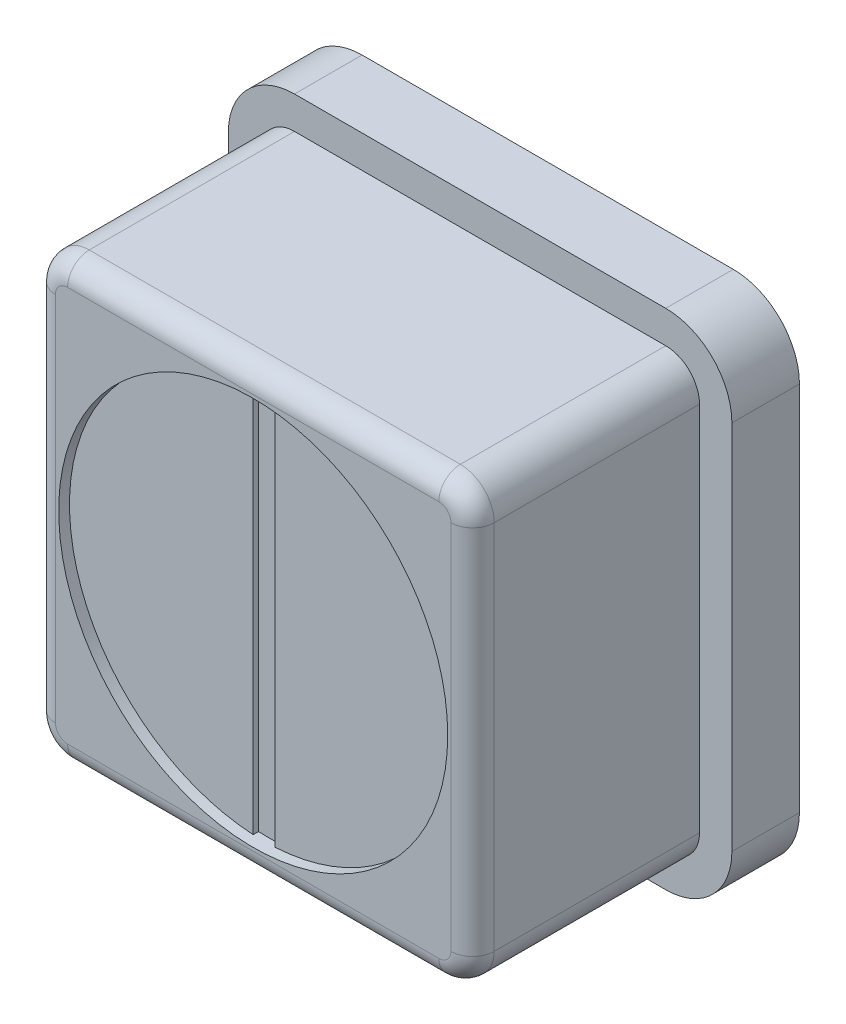
ISO-10303-21;
HEADER;
FILE_DESCRIPTION(('STEP AP214'),'2;1');
FILE_NAME('part.step','',(''),(''),'','','');
FILE_SCHEMA(('AUTOMOTIVE_DESIGN { 1 0 10303 214 1 1 1 1 }'));
ENDSEC;
DATA;
#1=APPLICATION_CONTEXT('core data for automotive mechanical design processes');
#2=APPLICATION_PROTOCOL_DEFINITION('international standard','automotive_design',2000,#1);
#3=PRODUCT_CONTEXT('',#1,'mechanical');
#4=PRODUCT('Part','Part','',(#3));
#5=PRODUCT_RELATED_PRODUCT_CATEGORY('part','',(#4));
#6=PRODUCT_DEFINITION_FORMATION('','',#4);
#7=PRODUCT_DEFINITION_CONTEXT('part definition',#1,'design');
#8=PRODUCT_DEFINITION('design','',#6,#7);
#9=PRODUCT_DEFINITION_SHAPE('','',#8);
#10=(LENGTH_UNIT() NAMED_UNIT(*) SI_UNIT(.MILLI.,.METRE.));
#11=(NAMED_UNIT(*) PLANE_ANGLE_UNIT() SI_UNIT($,.RADIAN.));
#12=(NAMED_UNIT(*) SI_UNIT($,.STERADIAN.) SOLID_ANGLE_UNIT());
#13=UNCERTAINTY_MEASURE_WITH_UNIT(LENGTH_MEASURE(1.E-05),#10,'distance_accuracy_value','');
#14=(GEOMETRIC_REPRESENTATION_CONTEXT(3) GLOBAL_UNCERTAINTY_ASSIGNED_CONTEXT((#13)) GLOBAL_UNIT_ASSIGNED_CONTEXT((#10,
#11,#12)) REPRESENTATION_CONTEXT('',''));
#15=CARTESIAN_POINT('',(0.,0.,0.));
#16=DIRECTION('',(0.,0.,1.));
#17=DIRECTION('',(1.,0.,0.));
#18=AXIS2_PLACEMENT_3D('',#15,#16,#17);
#19=CARTESIAN_POINT('',(0.,0.,-0.25400000000001));
#20=DIRECTION('',(0.,0.,1.));
#21=DIRECTION('',(1.,0.,0.));
#22=AXIS2_PLACEMENT_3D('',#19,#20,#21);
#23=PLANE('',#22);
#24=CARTESIAN_POINT('',(0.,0.,-0.25400000000001));
#25=DIRECTION('',(0.,0.,1.));
#26=DIRECTION('',(1.,0.,0.));
#27=AXIS2_PLACEMENT_3D('',#24,#25,#26);
#28=CIRCLE('',#27,4.572);
#29=CARTESIAN_POINT('',(-0.253999999999741,4.56493899192473,-0.253999999999978));
#30=VERTEX_POINT('',#29);
#31=CARTESIAN_POINT('',(-0.254000000000011,-4.56493899192587,-0.253999999999998));
#32=VERTEX_POINT('',#31);
#33=EDGE_CURVE('E283',#30,#32,#28,.T.);
#34=ORIENTED_EDGE('',*,*,#33,.T.);
#35=DIRECTION('',(0.,1.,0.));
#36=VECTOR('',#35,1.);
#37=CARTESIAN_POINT('',(-0.254000000000018,-5.68989300120393E-13,-0.253999999999998));
#38=LINE('',#37,#36);
#39=EDGE_CURVE('E239',#32,#30,#38,.T.);
#40=ORIENTED_EDGE('',*,*,#39,.T.);
#41=EDGE_LOOP('',(#34,#40));
#42=FACE_BOUND('',#41,.T.);
#43=ADVANCED_FACE('F47',(#42),#23,.T.);
#44=CARTESIAN_POINT('',(4.36244995388787,4.36244995397701,-5.33399999999997));
#45=DIRECTION('',(0.,0.,1.));
#46=DIRECTION('',(1.,0.,0.));
#47=AXIS2_PLACEMENT_3D('',#44,#45,#46);
#48=CYLINDRICAL_SURFACE('',#47,0.793750000000093);
#49=DIRECTION('',(0.,0.,1.));
#50=VECTOR('',#49,1.);
#51=CARTESIAN_POINT('',(4.36244689321046,5.15619995397119,-5.33399999999997));
#52=LINE('',#51,#50);
#53=CARTESIAN_POINT('',(4.36244689321046,5.15619995397119,-5.33399999999997));
#54=VERTEX_POINT('',#53);
#55=CARTESIAN_POINT('',(4.36244689321046,5.15619995397147,-0.507999999999951));
#56=VERTEX_POINT('',#55);
#57=EDGE_CURVE('E342',#54,#56,#52,.T.);
#58=ORIENTED_EDGE('',*,*,#57,.T.);
#59=CARTESIAN_POINT('',(4.36244995388787,4.36244995397701,-0.507999999999984));
#60=DIRECTION('',(0.,0.,1.));
#61=DIRECTION('',(1.,0.,0.));
#62=AXIS2_PLACEMENT_3D('',#59,#60,#61);
#63=CIRCLE('',#62,0.793750000000093);
#64=CARTESIAN_POINT('',(5.15619995388178,4.36244689321312,-0.50799999999998));
#65=VERTEX_POINT('',#64);
#66=EDGE_CURVE('E13',#56,#65,#63,.F.);
#67=ORIENTED_EDGE('',*,*,#66,.T.);
#68=DIRECTION('',(0.,0.,1.));
#69=VECTOR('',#68,1.);
#70=CARTESIAN_POINT('',(5.15619995388179,4.36244689321312,-5.33399999999997));
#71=LINE('',#70,#69);
#72=CARTESIAN_POINT('',(5.15619995388179,4.36244689321312,-5.33399999999997));
#73=VERTEX_POINT('',#72);
#74=EDGE_CURVE('E341',#73,#65,#71,.T.);
#75=ORIENTED_EDGE('',*,*,#74,.F.);
#76=CARTESIAN_POINT('',(4.36244995388787,4.36244995397701,-5.33399999999997));
#77=DIRECTION('',(0.,0.,1.));
#78=DIRECTION('',(1.,0.,0.));
#79=AXIS2_PLACEMENT_3D('',#76,#77,#78);
#80=CIRCLE('',#79,0.793750000000093);
#81=EDGE_CURVE('E290',#73,#54,#80,.T.);
#82=ORIENTED_EDGE('',*,*,#81,.T.);
#83=EDGE_LOOP('',(#58,#67,#75,#82));
#84=FACE_BOUND('',#83,.T.);
#85=ADVANCED_FACE('F451',(#84),#48,.T.);
#86=CARTESIAN_POINT('',(5.15619995388197,-4.36244689320725,-5.33399999999997));
#87=DIRECTION('',(1.,0.,0.));
#88=DIRECTION('',(0.,1.,0.));
#89=AXIS2_PLACEMENT_3D('',#86,#87,#88);
#90=PLANE('',#89);
#91=ORIENTED_EDGE('',*,*,#74,.T.);
#92=DIRECTION('',(0.,1.,0.));
#93=VECTOR('',#92,1.);
#94=CARTESIAN_POINT('',(5.15619995388196,-4.36244689320725,-0.507999999999957));
#95=LINE('',#94,#93);
#96=CARTESIAN_POINT('',(5.15619995388196,-4.36244689320725,-0.507999999999957));
#97=VERTEX_POINT('',#96);
#98=EDGE_CURVE('E321',#65,#97,#95,.F.);
#99=ORIENTED_EDGE('',*,*,#98,.T.);
#100=DIRECTION('',(0.,0.,1.));
#101=VECTOR('',#100,1.);
#102=CARTESIAN_POINT('',(5.15619995388197,-4.36244689320725,-5.33399999999997));
#103=LINE('',#102,#101);
#104=CARTESIAN_POINT('',(5.15619995388197,-4.36244689320725,-5.33399999999997));
#105=VERTEX_POINT('',#104);
#106=EDGE_CURVE('E359',#105,#97,#103,.T.);
#107=ORIENTED_EDGE('',*,*,#106,.F.);
#108=DIRECTION('',(0.,1.,0.));
#109=VECTOR('',#108,1.);
#110=CARTESIAN_POINT('',(5.15619995388197,-4.36244689320725,-5.33399999999997));
#111=LINE('',#110,#109);
#112=EDGE_CURVE('E345',#105,#73,#111,.T.);
#113=ORIENTED_EDGE('',*,*,#112,.T.);
#114=EDGE_LOOP('',(#91,#99,#107,#113));
#115=FACE_BOUND('',#114,.T.);
#116=ADVANCED_FACE('F448',(#115),#90,.T.);
#117=CARTESIAN_POINT('',(4.3624499538876,-4.36244995397112,-5.33399999999997));
#118=DIRECTION('',(0.,0.,1.));
#119=DIRECTION('',(1.,0.,0.));
#120=AXIS2_PLACEMENT_3D('',#117,#118,#119);
#121=CYLINDRICAL_SURFACE('',#120,0.793750000000093);
#122=ORIENTED_EDGE('',*,*,#106,.T.);
#123=CARTESIAN_POINT('',(4.36244995388758,-4.36244995397112,-0.507999999999958));
#124=DIRECTION('',(0.,0.,1.));
#125=DIRECTION('',(1.,0.,0.));
#126=AXIS2_PLACEMENT_3D('',#123,#124,#125);
#127=CIRCLE('',#126,0.793750000000093);
#128=CARTESIAN_POINT('',(4.36244988671362,-5.15619995397121,-0.507999999999957));
#129=VERTEX_POINT('',#128);
#130=EDGE_CURVE('E319',#97,#129,#127,.F.);
#131=ORIENTED_EDGE('',*,*,#130,.T.);
#132=DIRECTION('',(0.,0.,1.));
#133=VECTOR('',#132,1.);
#134=CARTESIAN_POINT('',(4.36244988671364,-5.15619995397121,-5.33399999999997));
#135=LINE('',#134,#133);
#136=CARTESIAN_POINT('',(4.36244988671364,-5.15619995397121,-5.33399999999997));
#137=VERTEX_POINT('',#136);
#138=EDGE_CURVE('E356',#137,#129,#135,.T.);
#139=ORIENTED_EDGE('',*,*,#138,.F.);
#140=CARTESIAN_POINT('',(4.3624499538876,-4.36244995397112,-5.33399999999997));
#141=DIRECTION('',(0.,0.,1.));
#142=DIRECTION('',(1.,0.,0.));
#143=AXIS2_PLACEMENT_3D('',#140,#141,#142);
#144=CIRCLE('',#143,0.793750000000093);
#145=EDGE_CURVE('E366',#137,#105,#144,.T.);
#146=ORIENTED_EDGE('',*,*,#145,.T.);
#147=EDGE_LOOP('',(#122,#131,#139,#146));
#148=FACE_BOUND('',#147,.T.);
#149=ADVANCED_FACE('F446',(#148),#121,.T.);
#150=CARTESIAN_POINT('',(-4.36244988671361,-5.15619995397121,-5.334));
#151=DIRECTION('',(0.,-1.,0.));
#152=DIRECTION('',(0.,0.,-1.));
#153=AXIS2_PLACEMENT_3D('',#150,#151,#152);
#154=PLANE('',#153);
#155=ORIENTED_EDGE('',*,*,#138,.T.);
#156=DIRECTION('',(1.,0.,0.));
#157=VECTOR('',#156,1.);
#158=CARTESIAN_POINT('',(-4.36244988671362,-5.15619995397121,-0.507999999999979));
#159=LINE('',#158,#157);
#160=CARTESIAN_POINT('',(-4.36244988671362,-5.15619995397121,-0.507999999999979));
#161=VERTEX_POINT('',#160);
#162=EDGE_CURVE('E317',#129,#161,#159,.F.);
#163=ORIENTED_EDGE('',*,*,#162,.T.);
#164=DIRECTION('',(0.,0.,1.));
#165=VECTOR('',#164,1.);
#166=CARTESIAN_POINT('',(-4.36244988671361,-5.15619995397121,-5.334));
#167=LINE('',#166,#165);
#168=CARTESIAN_POINT('',(-4.36244988671361,-5.15619995397121,-5.334));
#169=VERTEX_POINT('',#168);
#170=EDGE_CURVE('E353',#169,#161,#167,.T.);
#171=ORIENTED_EDGE('',*,*,#170,.F.);
#172=DIRECTION('',(1.,0.,0.));
#173=VECTOR('',#172,1.);
#174=CARTESIAN_POINT('',(-4.36244988671361,-5.15619995397121,-5.334));
#175=LINE('',#174,#173);
#176=EDGE_CURVE('E369',#169,#137,#175,.T.);
#177=ORIENTED_EDGE('',*,*,#176,.T.);
#178=EDGE_LOOP('',(#155,#163,#171,#177));
#179=FACE_BOUND('',#178,.T.);
#180=ADVANCED_FACE('F435',(#179),#154,.T.);
#181=CARTESIAN_POINT('',(-4.36244995391178,-4.36244995397112,-5.334));
#182=DIRECTION('',(0.,0.,1.));
#183=DIRECTION('',(1.,0.,0.));
#184=AXIS2_PLACEMENT_3D('',#181,#182,#183);
#185=CYLINDRICAL_SURFACE('',#184,0.793750000000093);
#186=ORIENTED_EDGE('',*,*,#170,.T.);
#187=CARTESIAN_POINT('',(-4.36244995391179,-4.36244995397112,-0.50799999999999));
#188=DIRECTION('',(0.,0.,1.));
#189=DIRECTION('',(1.,0.,0.));
#190=AXIS2_PLACEMENT_3D('',#187,#188,#189);
#191=CIRCLE('',#190,0.793750000000093);
#192=CARTESIAN_POINT('',(-5.15619995390598,-4.36245301467375,-0.507999999999994));
#193=VERTEX_POINT('',#192);
#194=EDGE_CURVE('E315',#161,#193,#191,.F.);
#195=ORIENTED_EDGE('',*,*,#194,.T.);
#196=DIRECTION('',(0.,0.,1.));
#197=VECTOR('',#196,1.);
#198=CARTESIAN_POINT('',(-5.15619995390595,-4.36245301467375,-5.334));
#199=LINE('',#198,#197);
#200=CARTESIAN_POINT('',(-5.15619995390595,-4.36245301467375,-5.334));
#201=VERTEX_POINT('',#200);
#202=EDGE_CURVE('E350',#201,#193,#199,.T.);
#203=ORIENTED_EDGE('',*,*,#202,.F.);
#204=CARTESIAN_POINT('',(-4.36244995391178,-4.36244995397112,-5.334));
#205=DIRECTION('',(0.,0.,1.));
#206=DIRECTION('',(1.,0.,0.));
#207=AXIS2_PLACEMENT_3D('',#204,#205,#206);
#208=CIRCLE('',#207,0.793750000000093);
#209=EDGE_CURVE('E372',#201,#169,#208,.T.);
#210=ORIENTED_EDGE('',*,*,#209,.T.);
#211=EDGE_LOOP('',(#186,#195,#203,#210));
#212=FACE_BOUND('',#211,.T.);
#213=ADVANCED_FACE('F438',(#212),#185,.T.);
#214=CARTESIAN_POINT('',(-5.15619995390595,4.36245301467375,-5.334));
#215=DIRECTION('',(-1.,0.,0.));
#216=DIRECTION('',(0.,0.,1.));
#217=AXIS2_PLACEMENT_3D('',#214,#215,#216);
#218=PLANE('',#217);
#219=ORIENTED_EDGE('',*,*,#202,.T.);
#220=DIRECTION('',(0.,-1.,0.));
#221=VECTOR('',#220,1.);
#222=CARTESIAN_POINT('',(-5.15619995390598,4.36245301467375,-0.508000000000012));
#223=LINE('',#222,#221);
#224=CARTESIAN_POINT('',(-5.15619995390598,4.36245301467375,-0.508000000000012));
#225=VERTEX_POINT('',#224);
#226=EDGE_CURVE('E313',#193,#225,#223,.F.);
#227=ORIENTED_EDGE('',*,*,#226,.T.);
#228=DIRECTION('',(0.,0.,1.));
#229=VECTOR('',#228,1.);
#230=CARTESIAN_POINT('',(-5.15619995390595,4.36245301467375,-5.334));
#231=LINE('',#230,#229);
#232=CARTESIAN_POINT('',(-5.1561999539116,4.36244995397701,-5.334));
#233=VERTEX_POINT('',#232);
#234=EDGE_CURVE('E347',#233,#225,#231,.T.);
#235=ORIENTED_EDGE('',*,*,#234,.F.);
#236=DIRECTION('',(0.,-1.,0.));
#237=VECTOR('',#236,1.);
#238=CARTESIAN_POINT('',(-5.15619995390595,4.36245301467375,-5.334));
#239=LINE('',#238,#237);
#240=EDGE_CURVE('E375',#233,#201,#239,.T.);
#241=ORIENTED_EDGE('',*,*,#240,.T.);
#242=EDGE_LOOP('',(#219,#227,#235,#241));
#243=FACE_BOUND('',#242,.T.);
#244=ADVANCED_FACE('F456',(#243),#218,.T.);
#245=CARTESIAN_POINT('',(-4.36244995391151,4.36244995397701,-5.334));
#246=DIRECTION('',(0.,0.,1.));
#247=DIRECTION('',(1.,0.,0.));
#248=AXIS2_PLACEMENT_3D('',#245,#246,#247);
#249=CYLINDRICAL_SURFACE('',#248,0.793750000000093);
#250=ORIENTED_EDGE('',*,*,#234,.T.);
#251=CARTESIAN_POINT('',(-4.36244995391151,4.36244995397701,-0.508000000000012));
#252=DIRECTION('',(0.,0.,1.));
#253=DIRECTION('',(1.,0.,0.));
#254=AXIS2_PLACEMENT_3D('',#251,#252,#253);
#255=CIRCLE('',#254,0.793750000000093);
#256=CARTESIAN_POINT('',(-4.36244689320989,5.15619995397117,-0.507999999999985));
#257=VERTEX_POINT('',#256);
#258=EDGE_CURVE('E311',#225,#257,#255,.F.);
#259=ORIENTED_EDGE('',*,*,#258,.T.);
#260=DIRECTION('',(0.,0.,1.));
#261=VECTOR('',#260,1.);
#262=CARTESIAN_POINT('',(-4.36244689320989,5.15619995397085,-5.334));
#263=LINE('',#262,#261);
#264=CARTESIAN_POINT('',(-4.36244689320989,5.15619995397085,-5.334));
#265=VERTEX_POINT('',#264);
#266=EDGE_CURVE('E344',#265,#257,#263,.T.);
#267=ORIENTED_EDGE('',*,*,#266,.F.);
#268=CARTESIAN_POINT('',(-4.36244995391151,4.36244995397701,-5.334));
#269=DIRECTION('',(0.,0.,1.));
#270=DIRECTION('',(1.,0.,0.));
#271=AXIS2_PLACEMENT_3D('',#268,#269,#270);
#272=CIRCLE('',#271,0.793750000000093);
#273=EDGE_CURVE('E378',#265,#233,#272,.T.);
#274=ORIENTED_EDGE('',*,*,#273,.T.);
#275=EDGE_LOOP('',(#250,#259,#267,#274));
#276=FACE_BOUND('',#275,.T.);
#277=ADVANCED_FACE('F454',(#276),#249,.T.);
#278=CARTESIAN_POINT('',(4.36244689321046,5.15619995397119,-5.33399999999997));
#279=DIRECTION('',(0.,1.,0.));
#280=DIRECTION('',(0.,0.,1.));
#281=AXIS2_PLACEMENT_3D('',#278,#279,#280);
#282=PLANE('',#281);
#283=ORIENTED_EDGE('',*,*,#266,.T.);
#284=DIRECTION('',(-1.,0.,0.));
#285=VECTOR('',#284,1.);
#286=CARTESIAN_POINT('',(4.36244689321046,5.15619995397147,-0.507999999999951));
#287=LINE('',#286,#285);
#288=EDGE_CURVE('E56',#257,#56,#287,.F.);
#289=ORIENTED_EDGE('',*,*,#288,.T.);
#290=ORIENTED_EDGE('',*,*,#57,.F.);
#291=DIRECTION('',(-1.,0.,0.));
#292=VECTOR('',#291,1.);
#293=CARTESIAN_POINT('',(4.36244689321046,5.15619995397119,-5.33399999999997));
#294=LINE('',#293,#292);
#295=EDGE_CURVE('E381',#54,#265,#294,.T.);
#296=ORIENTED_EDGE('',*,*,#295,.T.);
#297=EDGE_LOOP('',(#283,#289,#290,#296));
#298=FACE_BOUND('',#297,.T.);
#299=ADVANCED_FACE('F393',(#298),#282,.T.);
#300=CARTESIAN_POINT('',(4.36244995388787,4.36244995397701,0.));
#301=DIRECTION('',(0.,0.,1.));
#302=DIRECTION('',(1.,0.,0.));
#303=AXIS2_PLACEMENT_3D('',#300,#301,#302);
#304=PLANE('',#303);
#305=CARTESIAN_POINT('',(0.,0.,0.));
#306=DIRECTION('',(0.,0.,1.));
#307=DIRECTION('',(1.,0.,0.));
#308=AXIS2_PLACEMENT_3D('',#305,#306,#307);
#309=CIRCLE('',#308,4.572);
#310=CARTESIAN_POINT('',(4.57199999999999,0.,0.));
#311=VERTEX_POINT('',#310);
#312=EDGE_CURVE('E275',#311,#311,#309,.T.);
#313=ORIENTED_EDGE('',*,*,#312,.F.);
#314=EDGE_LOOP('',(#313));
#315=FACE_BOUND('',#314,.T.);
#316=CARTESIAN_POINT('',(4.36244995388758,-4.36244995397112,0.));
#317=DIRECTION('',(0.,0.,1.));
#318=DIRECTION('',(1.,0.,0.));
#319=AXIS2_PLACEMENT_3D('',#316,#317,#318);
#320=CIRCLE('',#319,0.285750000000093);
#321=CARTESIAN_POINT('',(4.36244992970496,-4.64819995397121,0.));
#322=VERTEX_POINT('',#321);
#323=CARTESIAN_POINT('',(4.64819995387144,-4.36244689320672,0.));
#324=VERTEX_POINT('',#323);
#325=EDGE_CURVE('E327',#322,#324,#320,.T.);
#326=ORIENTED_EDGE('',*,*,#325,.T.);
#327=DIRECTION('',(0.,1.,0.));
#328=VECTOR('',#327,1.);
#329=CARTESIAN_POINT('',(4.64819995388206,4.36244995397754,0.));
#330=LINE('',#329,#328);
#331=CARTESIAN_POINT('',(4.64819995387124,4.36244689321365,0.));
#332=VERTEX_POINT('',#331);
#333=EDGE_CURVE('E324',#324,#332,#330,.T.);
#334=ORIENTED_EDGE('',*,*,#333,.T.);
#335=CARTESIAN_POINT('',(4.36244995388787,4.36244995397701,0.));
#336=DIRECTION('',(0.,0.,1.));
#337=DIRECTION('',(1.,0.,0.));
#338=AXIS2_PLACEMENT_3D('',#335,#336,#337);
#339=CIRCLE('',#338,0.285750000000093);
#340=CARTESIAN_POINT('',(4.36244689321046,4.64819995396097,0.));
#341=VERTEX_POINT('',#340);
#342=EDGE_CURVE('E339',#332,#341,#339,.T.);
#343=ORIENTED_EDGE('',*,*,#342,.T.);
#344=DIRECTION('',(-1.,0.,0.));
#345=VECTOR('',#344,1.);
#346=CARTESIAN_POINT('',(4.36244995388787,4.64819995397119,0.));
#347=LINE('',#346,#345);
#348=CARTESIAN_POINT('',(-4.36244885205893,4.64819995397146,0.));
#349=VERTEX_POINT('',#348);
#350=EDGE_CURVE('E337',#341,#349,#347,.T.);
#351=ORIENTED_EDGE('',*,*,#350,.T.);
#352=CARTESIAN_POINT('',(-4.36244995391151,4.36244995397701,0.));
#353=DIRECTION('',(0.,0.,1.));
#354=DIRECTION('',(1.,0.,0.));
#355=AXIS2_PLACEMENT_3D('',#352,#353,#354);
#356=CIRCLE('',#355,0.285750000000093);
#357=CARTESIAN_POINT('',(-4.64819995389549,4.36245301467345,0.));
#358=VERTEX_POINT('',#357);
#359=EDGE_CURVE('E335',#349,#358,#356,.T.);
#360=ORIENTED_EDGE('',*,*,#359,.T.);
#361=DIRECTION('',(0.,-1.,0.));
#362=VECTOR('',#361,1.);
#363=CARTESIAN_POINT('',(-4.6481999539057,4.36244995397671,0.));
#364=LINE('',#363,#362);
#365=CARTESIAN_POINT('',(-4.6481999539057,-4.36245105582438,0.));
#366=VERTEX_POINT('',#365);
#367=EDGE_CURVE('E333',#358,#366,#364,.T.);
#368=ORIENTED_EDGE('',*,*,#367,.T.);
#369=CARTESIAN_POINT('',(-4.36244995391179,-4.36244995397112,0.));
#370=DIRECTION('',(0.,0.,1.));
#371=DIRECTION('',(1.,0.,0.));
#372=AXIS2_PLACEMENT_3D('',#369,#370,#371);
#373=CIRCLE('',#372,0.285750000000093);
#374=CARTESIAN_POINT('',(-4.36244988671362,-4.6481999539712,0.));
#375=VERTEX_POINT('',#374);
#376=EDGE_CURVE('E331',#366,#375,#373,.T.);
#377=ORIENTED_EDGE('',*,*,#376,.T.);
#378=DIRECTION('',(1.,0.,0.));
#379=VECTOR('',#378,1.);
#380=CARTESIAN_POINT('',(4.36244995388758,-4.64819995397121,0.));
#381=LINE('',#380,#379);
#382=EDGE_CURVE('E329',#375,#322,#381,.T.);
#383=ORIENTED_EDGE('',*,*,#382,.T.);
#384=EDGE_LOOP('',(#326,#334,#343,#351,#360,#368,#377,#383));
#385=FACE_BOUND('',#384,.T.);
#386=ADVANCED_FACE('F390',(#315,#385),#304,.T.);
#387=CARTESIAN_POINT('',(-4.6481999539057,4.36244995397671,-0.508000000000007));
#388=DIRECTION('',(0.,-1.,0.));
#389=DIRECTION('',(0.,0.,-1.));
#390=AXIS2_PLACEMENT_3D('',#387,#388,#389);
#391=CYLINDRICAL_SURFACE('',#390,0.508);
#392=CARTESIAN_POINT('',(-4.64819995390598,4.36245301467345,-0.508000000000007));
#393=DIRECTION('',(0.,1.,0.));
#394=DIRECTION('',(0.,0.,1.));
#395=AXIS2_PLACEMENT_3D('',#392,#393,#394);
#396=CIRCLE('',#395,0.508);
#397=EDGE_CURVE('E291',#225,#358,#396,.T.);
#398=ORIENTED_EDGE('',*,*,#397,.F.);
#399=ORIENTED_EDGE('',*,*,#226,.F.);
#400=CARTESIAN_POINT('',(-4.6481999539057,-4.36245105582438,-0.507999999999985));
#401=DIRECTION('',(3.85600331326566E-06,-0.999999999992566,0.));
#402=DIRECTION('',(0.999999999992566,3.85600331326566E-06,0.));
#403=AXIS2_PLACEMENT_3D('',#400,#401,#402);
#404=CIRCLE('',#403,0.508);
#405=EDGE_CURVE('E286',#366,#193,#404,.T.);
#406=ORIENTED_EDGE('',*,*,#405,.F.);
#407=ORIENTED_EDGE('',*,*,#367,.F.);
#408=EDGE_LOOP('',(#398,#399,#406,#407));
#409=FACE_BOUND('',#408,.T.);
#410=ADVANCED_FACE('F49',(#409),#391,.T.);
#411=CARTESIAN_POINT('',(-4.36244995391179,-4.36244995397112,-0.50799999999999));
#412=DIRECTION('',(0.,0.,1.));
#413=DIRECTION('',(1.,0.,0.));
#414=AXIS2_PLACEMENT_3D('',#411,#412,#413);
#415=DEGENERATE_TOROIDAL_SURFACE('',#414,0.285750000000093,0.508,.T.);
#416=ORIENTED_EDGE('',*,*,#405,.T.);
#417=ORIENTED_EDGE('',*,*,#194,.F.);
#418=CARTESIAN_POINT('',(-4.36244988671362,-4.6481999539712,-0.507999999999979));
#419=DIRECTION('',(1.,0.,0.));
#420=DIRECTION('',(0.,0.,-1.));
#421=AXIS2_PLACEMENT_3D('',#418,#419,#420);
#422=CIRCLE('',#421,0.508);
#423=EDGE_CURVE('E294',#375,#161,#422,.T.);
#424=ORIENTED_EDGE('',*,*,#423,.F.);
#425=ORIENTED_EDGE('',*,*,#376,.F.);
#426=EDGE_LOOP('',(#416,#417,#424,#425));
#427=FACE_BOUND('',#426,.T.);
#428=ADVANCED_FACE('F429',(#427),#415,.T.);
#429=CARTESIAN_POINT('',(-4.36244995391151,4.36244995397701,-0.508000000000012));
#430=DIRECTION('',(0.,0.,1.));
#431=DIRECTION('',(1.,0.,0.));
#432=AXIS2_PLACEMENT_3D('',#429,#430,#431);
#433=DEGENERATE_TOROIDAL_SURFACE('',#432,0.285750000000093,0.508,.T.);
#434=ORIENTED_EDGE('',*,*,#397,.T.);
#435=ORIENTED_EDGE('',*,*,#359,.F.);
#436=CARTESIAN_POINT('',(-4.36244885205893,4.64819995397524,-0.507999999999985));
#437=DIRECTION('',(0.999999999992566,-3.85600202932577E-06,0.));
#438=DIRECTION('',(3.85600202932577E-06,0.999999999992566,0.));
#439=AXIS2_PLACEMENT_3D('',#436,#437,#438);
#440=CIRCLE('',#439,0.508);
#441=EDGE_CURVE('E297',#257,#349,#440,.T.);
#442=ORIENTED_EDGE('',*,*,#441,.F.);
#443=ORIENTED_EDGE('',*,*,#258,.F.);
#444=EDGE_LOOP('',(#434,#435,#442,#443));
#445=FACE_BOUND('',#444,.T.);
#446=ADVANCED_FACE('F419',(#445),#433,.T.);
#447=CARTESIAN_POINT('',(4.36244995388758,-4.64819995397121,-0.507999999999957));
#448=DIRECTION('',(1.,0.,0.));
#449=DIRECTION('',(0.,0.,-1.));
#450=AXIS2_PLACEMENT_3D('',#447,#448,#449);
#451=CYLINDRICAL_SURFACE('',#450,0.508);
#452=ORIENTED_EDGE('',*,*,#423,.T.);
#453=ORIENTED_EDGE('',*,*,#162,.F.);
#454=CARTESIAN_POINT('',(4.36244992970496,-4.64819995397121,-0.507999999999957));
#455=DIRECTION('',(0.999999999999997,-8.46286128309028E-08,0.));
#456=DIRECTION('',(8.46286128309028E-08,0.999999999999997,0.));
#457=AXIS2_PLACEMENT_3D('',#454,#455,#456);
#458=CIRCLE('',#457,0.508);
#459=EDGE_CURVE('E300',#322,#129,#458,.T.);
#460=ORIENTED_EDGE('',*,*,#459,.F.);
#461=ORIENTED_EDGE('',*,*,#382,.F.);
#462=EDGE_LOOP('',(#452,#453,#460,#461));
#463=FACE_BOUND('',#462,.T.);
#464=ADVANCED_FACE('F432',(#463),#451,.T.);
#465=CARTESIAN_POINT('',(4.36244995388787,4.64819995397119,-0.507999999999951));
#466=DIRECTION('',(-1.,0.,0.));
#467=DIRECTION('',(0.,0.,1.));
#468=AXIS2_PLACEMENT_3D('',#465,#466,#467);
#469=CYLINDRICAL_SURFACE('',#468,0.508);
#470=ORIENTED_EDGE('',*,*,#441,.T.);
#471=ORIENTED_EDGE('',*,*,#350,.F.);
#472=CARTESIAN_POINT('',(4.36244689321046,4.64819995397146,-0.507999999999951));
#473=DIRECTION('',(1.,0.,0.));
#474=DIRECTION('',(0.,0.,-1.));
#475=AXIS2_PLACEMENT_3D('',#472,#473,#474);
#476=CIRCLE('',#475,0.508);
#477=EDGE_CURVE('E303',#56,#341,#476,.T.);
#478=ORIENTED_EDGE('',*,*,#477,.F.);
#479=ORIENTED_EDGE('',*,*,#288,.F.);
#480=EDGE_LOOP('',(#470,#471,#478,#479));
#481=FACE_BOUND('',#480,.T.);
#482=ADVANCED_FACE('F415',(#481),#469,.T.);
#483=CARTESIAN_POINT('',(4.36244995388758,-4.36244995397112,-0.507999999999958));
#484=DIRECTION('',(0.,0.,1.));
#485=DIRECTION('',(1.,0.,0.));
#486=AXIS2_PLACEMENT_3D('',#483,#484,#485);
#487=DEGENERATE_TOROIDAL_SURFACE('',#486,0.285750000000093,0.508,.T.);
#488=ORIENTED_EDGE('',*,*,#459,.T.);
#489=ORIENTED_EDGE('',*,*,#130,.F.);
#490=CARTESIAN_POINT('',(4.64819995387144,-4.36244689320672,-0.507999999999957));
#491=DIRECTION('',(0.,1.,0.));
#492=DIRECTION('',(0.,0.,1.));
#493=AXIS2_PLACEMENT_3D('',#490,#491,#492);
#494=CIRCLE('',#493,0.508);
#495=EDGE_CURVE('E306',#324,#97,#494,.T.);
#496=ORIENTED_EDGE('',*,*,#495,.F.);
#497=ORIENTED_EDGE('',*,*,#325,.F.);
#498=EDGE_LOOP('',(#488,#489,#496,#497));
#499=FACE_BOUND('',#498,.T.);
#500=ADVANCED_FACE('F402',(#499),#487,.T.);
#501=CARTESIAN_POINT('',(4.36244995388787,4.36244995397701,-0.507999999999984));
#502=DIRECTION('',(0.,0.,1.));
#503=DIRECTION('',(1.,0.,0.));
#504=AXIS2_PLACEMENT_3D('',#501,#502,#503);
#505=DEGENERATE_TOROIDAL_SURFACE('',#504,0.285750000000093,0.508,.T.);
#506=ORIENTED_EDGE('',*,*,#477,.T.);
#507=ORIENTED_EDGE('',*,*,#342,.F.);
#508=CARTESIAN_POINT('',(4.64819995388584,4.36244885210253,-0.507999999999983));
#509=DIRECTION('',(-3.85608050504553E-06,-0.999999999985131,-3.85608050512517E-06));
#510=DIRECTION('',(0.,3.85608050515384E-06,-0.999999999992566));
#511=AXIS2_PLACEMENT_3D('',#508,#509,#510);
#512=CIRCLE('',#511,0.508);
#513=EDGE_CURVE('E308',#65,#332,#512,.T.);
#514=ORIENTED_EDGE('',*,*,#513,.F.);
#515=ORIENTED_EDGE('',*,*,#66,.F.);
#516=EDGE_LOOP('',(#506,#507,#514,#515));
#517=FACE_BOUND('',#516,.T.);
#518=ADVANCED_FACE('F410',(#517),#505,.T.);
#519=CARTESIAN_POINT('',(4.64819995388206,4.36244995397754,-0.507999999999983));
#520=DIRECTION('',(0.,1.,0.));
#521=DIRECTION('',(-1.,0.,0.));
#522=AXIS2_PLACEMENT_3D('',#519,#520,#521);
#523=CYLINDRICAL_SURFACE('',#522,0.508);
#524=ORIENTED_EDGE('',*,*,#495,.T.);
#525=ORIENTED_EDGE('',*,*,#98,.F.);
#526=ORIENTED_EDGE('',*,*,#513,.T.);
#527=ORIENTED_EDGE('',*,*,#333,.F.);
#528=EDGE_LOOP('',(#524,#525,#526,#527));
#529=FACE_BOUND('',#528,.T.);
#530=ADVANCED_FACE('F405',(#529),#523,.T.);
#531=CARTESIAN_POINT('',(0.,0.,-0.25400000000001));
#532=DIRECTION('',(0.,0.,1.));
#533=DIRECTION('',(1.,0.,0.));
#534=AXIS2_PLACEMENT_3D('',#531,#532,#533);
#535=CYLINDRICAL_SURFACE('',#534,4.572);
#536=ORIENTED_EDGE('',*,*,#33,.F.);
#537=DIRECTION('',(0.,0.,1.));
#538=VECTOR('',#537,1.);
#539=CARTESIAN_POINT('',(-0.253999999999741,4.56493899192473,-0.380999999999981));
#540=LINE('',#539,#538);
#541=CARTESIAN_POINT('',(-0.253999999999741,4.56493899192473,-0.380999999999981));
#542=VERTEX_POINT('',#541);
#543=EDGE_CURVE('E64',#542,#30,#540,.T.);
#544=ORIENTED_EDGE('',*,*,#543,.F.);
#545=CARTESIAN_POINT('',(0.,0.,-0.381000000000012));
#546=DIRECTION('',(0.,0.,1.));
#547=DIRECTION('',(1.,0.,0.));
#548=AXIS2_PLACEMENT_3D('',#545,#546,#547);
#549=CIRCLE('',#548,4.572);
#550=CARTESIAN_POINT('',(0.254000000000268,4.56493899192582,-0.380999999999981));
#551=VERTEX_POINT('',#550);
#552=EDGE_CURVE('E249',#551,#542,#549,.T.);
#553=ORIENTED_EDGE('',*,*,#552,.F.);
#554=DIRECTION('',(0.,0.,1.));
#555=VECTOR('',#554,1.);
#556=CARTESIAN_POINT('',(0.254000000000268,4.56493899192582,-0.380999999999981));
#557=LINE('',#556,#555);
#558=CARTESIAN_POINT('',(0.254000000000268,4.56493899192582,-0.253999999999978));
#559=VERTEX_POINT('',#558);
#560=EDGE_CURVE('E262',#551,#559,#557,.T.);
#561=ORIENTED_EDGE('',*,*,#560,.T.);
#562=CARTESIAN_POINT('',(0.253999999999983,-4.56493899192477,-0.253999999999998));
#563=VERTEX_POINT('',#562);
#564=EDGE_CURVE('E279',#563,#559,#28,.T.);
#565=ORIENTED_EDGE('',*,*,#564,.F.);
#566=DIRECTION('',(0.,0.,1.));
#567=VECTOR('',#566,1.);
#568=CARTESIAN_POINT('',(0.253999999999983,-4.56493899192477,-0.381));
#569=LINE('',#568,#567);
#570=CARTESIAN_POINT('',(0.253999999999983,-4.56493899192477,-0.381));
#571=VERTEX_POINT('',#570);
#572=EDGE_CURVE('E254',#571,#563,#569,.T.);
#573=ORIENTED_EDGE('',*,*,#572,.F.);
#574=CARTESIAN_POINT('',(-0.254000000000011,-4.56493899192587,-0.381));
#575=VERTEX_POINT('',#574);
#576=EDGE_CURVE('E245',#575,#571,#549,.T.);
#577=ORIENTED_EDGE('',*,*,#576,.F.);
#578=DIRECTION('',(0.,0.,1.));
#579=VECTOR('',#578,1.);
#580=CARTESIAN_POINT('',(-0.254000000000011,-4.56493899192587,-0.381));
#581=LINE('',#580,#579);
#582=EDGE_CURVE('E266',#575,#32,#581,.T.);
#583=ORIENTED_EDGE('',*,*,#582,.T.);
#584=EDGE_LOOP('',(#536,#544,#553,#561,#565,#573,#577,#583));
#585=FACE_BOUND('',#584,.T.);
#586=ORIENTED_EDGE('',*,*,#312,.T.);
#587=EDGE_LOOP('',(#586));
#588=FACE_BOUND('',#587,.T.);
#589=ADVANCED_FACE('F388',(#585,#588),#535,.F.);
#590=DIRECTION('',(0.,1.,0.));
#591=VECTOR('',#590,1.);
#592=CARTESIAN_POINT('',(0.253999999999983,5.27355936696949E-13,-0.253999999999998));
#593=LINE('',#592,#591);
#594=EDGE_CURVE('E236',#563,#559,#593,.T.);
#595=ORIENTED_EDGE('',*,*,#594,.F.);
#596=ORIENTED_EDGE('',*,*,#564,.T.);
#597=EDGE_LOOP('',(#595,#596));
#598=FACE_BOUND('',#597,.T.);
#599=ADVANCED_FACE('F468',(#598),#23,.T.);
#600=CARTESIAN_POINT('',(-0.254000000000018,-5.68989300120393E-13,-0.381));
#601=DIRECTION('',(1.,0.,0.));
#602=DIRECTION('',(0.,1.,0.));
#603=AXIS2_PLACEMENT_3D('',#600,#601,#602);
#604=PLANE('',#603);
#605=ORIENTED_EDGE('',*,*,#39,.F.);
#606=ORIENTED_EDGE('',*,*,#582,.F.);
#607=DIRECTION('',(0.,1.,0.));
#608=VECTOR('',#607,1.);
#609=CARTESIAN_POINT('',(-0.254000000000018,-5.68989300120393E-13,-0.381));
#610=LINE('',#609,#608);
#611=EDGE_CURVE('E252',#575,#542,#610,.T.);
#612=ORIENTED_EDGE('',*,*,#611,.T.);
#613=ORIENTED_EDGE('',*,*,#543,.T.);
#614=EDGE_LOOP('',(#605,#606,#612,#613));
#615=FACE_BOUND('',#614,.T.);
#616=ADVANCED_FACE('F477',(#615),#604,.T.);
#617=CARTESIAN_POINT('',(0.253999999999983,5.27355936696949E-13,-0.381));
#618=DIRECTION('',(1.,0.,0.));
#619=DIRECTION('',(0.,0.,-1.));
#620=AXIS2_PLACEMENT_3D('',#617,#618,#619);
#621=PLANE('',#620);
#622=ORIENTED_EDGE('',*,*,#594,.T.);
#623=ORIENTED_EDGE('',*,*,#560,.F.);
#624=DIRECTION('',(0.,1.,0.));
#625=VECTOR('',#624,1.);
#626=CARTESIAN_POINT('',(0.253999999999983,5.27355936696949E-13,-0.381));
#627=LINE('',#626,#625);
#628=EDGE_CURVE('E248',#571,#551,#627,.T.);
#629=ORIENTED_EDGE('',*,*,#628,.F.);
#630=ORIENTED_EDGE('',*,*,#572,.T.);
#631=EDGE_LOOP('',(#622,#623,#629,#630));
#632=FACE_BOUND('',#631,.T.);
#633=ADVANCED_FACE('F483',(#632),#621,.F.);
#634=CARTESIAN_POINT('',(0.,0.,-0.381000000000012));
#635=DIRECTION('',(0.,0.,1.));
#636=DIRECTION('',(1.,0.,0.));
#637=AXIS2_PLACEMENT_3D('',#634,#635,#636);
#638=PLANE('',#637);
#639=ORIENTED_EDGE('',*,*,#576,.T.);
#640=ORIENTED_EDGE('',*,*,#628,.T.);
#641=ORIENTED_EDGE('',*,*,#552,.T.);
#642=ORIENTED_EDGE('',*,*,#611,.F.);
#643=EDGE_LOOP('',(#639,#640,#641,#642));
#644=FACE_BOUND('',#643,.T.);
#645=ADVANCED_FACE('F490',(#644),#638,.T.);
#646=CARTESIAN_POINT('',(4.36244995388779,4.36244995397701,-6.92149999999993));
#647=DIRECTION('',(0.,0.,1.));
#648=DIRECTION('',(1.,0.,0.));
#649=AXIS2_PLACEMENT_3D('',#646,#647,#648);
#650=CYLINDRICAL_SURFACE('',#649,1.55575000000009);
#651=CARTESIAN_POINT('',(4.36244995388787,4.36244995397701,-5.33399999999997));
#652=DIRECTION('',(0.,0.,-1.));
#653=DIRECTION('',(-1.,0.,0.));
#654=AXIS2_PLACEMENT_3D('',#651,#652,#653);
#655=CIRCLE('',#654,1.55575000000009);
#656=CARTESIAN_POINT('',(4.36244395496015,5.9181999539652,-5.33399999999997));
#657=VERTEX_POINT('',#656);
#658=CARTESIAN_POINT('',(5.91819995387639,4.36244395487946,-5.33399999999997));
#659=VERTEX_POINT('',#658);
#660=EDGE_CURVE('E235',#657,#659,#655,.T.);
#661=ORIENTED_EDGE('',*,*,#660,.T.);
#662=DIRECTION('',(0.,0.,1.));
#663=VECTOR('',#662,1.);
#664=CARTESIAN_POINT('',(5.91819995387632,4.36244395487946,-6.92149999999997));
#665=LINE('',#664,#663);
#666=CARTESIAN_POINT('',(5.91819995387632,4.36244395487946,-6.92149999999997));
#667=VERTEX_POINT('',#666);
#668=EDGE_CURVE('E215',#667,#659,#665,.T.);
#669=ORIENTED_EDGE('',*,*,#668,.F.);
#670=CARTESIAN_POINT('',(4.36244995388779,4.36244995397701,-6.92149999999993));
#671=DIRECTION('',(0.,0.,-1.));
#672=DIRECTION('',(-1.,0.,0.));
#673=AXIS2_PLACEMENT_3D('',#670,#671,#672);
#674=CIRCLE('',#673,1.55575000000009);
#675=CARTESIAN_POINT('',(4.36244395496008,5.9181999539652,-6.92149999999997));
#676=VERTEX_POINT('',#675);
#677=EDGE_CURVE('E222',#676,#667,#674,.T.);
#678=ORIENTED_EDGE('',*,*,#677,.F.);
#679=DIRECTION('',(0.,0.,1.));
#680=VECTOR('',#679,1.);
#681=CARTESIAN_POINT('',(4.36244395496008,5.9181999539652,-6.92149999999997));
#682=LINE('',#681,#680);
#683=EDGE_CURVE('E559',#676,#657,#682,.T.);
#684=ORIENTED_EDGE('',*,*,#683,.T.);
#685=EDGE_LOOP('',(#661,#669,#678,#684));
#686=FACE_BOUND('',#685,.T.);
#687=ADVANCED_FACE('F233',(#686),#650,.T.);
#688=CARTESIAN_POINT('',(5.91819995387632,4.36244395487946,-6.92149999999997));
#689=DIRECTION('',(-1.,-6.493613468852E-13,0.));
#690=DIRECTION('',(6.493613468852E-13,-1.,0.));
#691=AXIS2_PLACEMENT_3D('',#688,#689,#690);
#692=PLANE('',#691);
#693=DIRECTION('',(6.493613468852E-13,-1.,0.));
#694=VECTOR('',#693,1.);
#695=CARTESIAN_POINT('',(5.91819995387639,4.36244395487946,-5.33399999999997));
#696=LINE('',#695,#694);
#697=CARTESIAN_POINT('',(5.91819995388342,-4.36244689320756,-5.33399999999997));
#698=VERTEX_POINT('',#697);
#699=EDGE_CURVE('E561',#659,#698,#696,.T.);
#700=ORIENTED_EDGE('',*,*,#699,.T.);
#701=DIRECTION('',(0.,0.,1.));
#702=VECTOR('',#701,1.);
#703=CARTESIAN_POINT('',(5.91819995388334,-4.36244689320756,-6.92149999999997));
#704=LINE('',#703,#702);
#705=CARTESIAN_POINT('',(5.91819995388334,-4.36244689320756,-6.92149999999997));
#706=VERTEX_POINT('',#705);
#707=EDGE_CURVE('E218',#706,#698,#704,.T.);
#708=ORIENTED_EDGE('',*,*,#707,.F.);
#709=DIRECTION('',(6.493613468852E-13,-1.,0.));
#710=VECTOR('',#709,1.);
#711=CARTESIAN_POINT('',(5.91819995387632,4.36244395487946,-6.92149999999997));
#712=LINE('',#711,#710);
#713=EDGE_CURVE('E211',#667,#706,#712,.T.);
#714=ORIENTED_EDGE('',*,*,#713,.F.);
#715=ORIENTED_EDGE('',*,*,#668,.T.);
#716=EDGE_LOOP('',(#700,#708,#714,#715));
#717=FACE_BOUND('',#716,.T.);
#718=ADVANCED_FACE('F213',(#717),#692,.F.);
#719=CARTESIAN_POINT('',(4.36244995388758,-4.36244995397112,-6.92149999999993));
#720=DIRECTION('',(0.,0.,1.));
#721=DIRECTION('',(1.,0.,0.));
#722=AXIS2_PLACEMENT_3D('',#719,#720,#721);
#723=CYLINDRICAL_SURFACE('',#722,1.55574999999865);
#724=CARTESIAN_POINT('',(4.3624499538876,-4.36244995397112,-5.33399999999997));
#725=DIRECTION('',(0.,0.,-1.));
#726=DIRECTION('',(-1.,0.,0.));
#727=AXIS2_PLACEMENT_3D('',#724,#725,#726);
#728=CIRCLE('',#727,1.55574999999865);
#729=CARTESIAN_POINT('',(4.36244982222664,-5.91819995397121,-5.33399999999997));
#730=VERTEX_POINT('',#729);
#731=EDGE_CURVE('E563',#698,#730,#728,.T.);
#732=ORIENTED_EDGE('',*,*,#731,.T.);
#733=DIRECTION('',(0.,0.,1.));
#734=VECTOR('',#733,1.);
#735=CARTESIAN_POINT('',(4.36244982222662,-5.91819995397121,-6.92150000000002));
#736=LINE('',#735,#734);
#737=CARTESIAN_POINT('',(4.36244982222662,-5.91819995397121,-6.92150000000002));
#738=VERTEX_POINT('',#737);
#739=EDGE_CURVE('E241',#738,#730,#736,.T.);
#740=ORIENTED_EDGE('',*,*,#739,.F.);
#741=CARTESIAN_POINT('',(4.36244995388758,-4.36244995397112,-6.92149999999993));
#742=DIRECTION('',(0.,0.,-1.));
#743=DIRECTION('',(-1.,0.,0.));
#744=AXIS2_PLACEMENT_3D('',#741,#742,#743);
#745=CIRCLE('',#744,1.55574999999865);
#746=EDGE_CURVE('E221',#706,#738,#745,.T.);
#747=ORIENTED_EDGE('',*,*,#746,.F.);
#748=ORIENTED_EDGE('',*,*,#707,.T.);
#749=EDGE_LOOP('',(#732,#740,#747,#748));
#750=FACE_BOUND('',#749,.T.);
#751=ADVANCED_FACE('F501',(#750),#723,.T.);
#752=CARTESIAN_POINT('',(4.36244982222662,-5.91819995397121,-6.92150000000002));
#753=DIRECTION('',(0.,1.,0.));
#754=DIRECTION('',(-1.,0.,0.));
#755=AXIS2_PLACEMENT_3D('',#752,#753,#754);
#756=PLANE('',#755);
#757=DIRECTION('',(-1.,0.,0.));
#758=VECTOR('',#757,1.);
#759=CARTESIAN_POINT('',(4.36244982222664,-5.91819995397121,-5.33399999999997));
#760=LINE('',#759,#758);
#761=CARTESIAN_POINT('',(-4.36244988671361,-5.91819995397121,-5.334));
#762=VERTEX_POINT('',#761);
#763=EDGE_CURVE('E565',#730,#762,#760,.T.);
#764=ORIENTED_EDGE('',*,*,#763,.T.);
#765=DIRECTION('',(0.,0.,1.));
#766=VECTOR('',#765,1.);
#767=CARTESIAN_POINT('',(-4.36244988671362,-5.91819995397121,-6.92150000000006));
#768=LINE('',#767,#766);
#769=CARTESIAN_POINT('',(-4.36244988671362,-5.91819995397121,-6.92150000000006));
#770=VERTEX_POINT('',#769);
#771=EDGE_CURVE('E584',#770,#762,#768,.T.);
#772=ORIENTED_EDGE('',*,*,#771,.F.);
#773=DIRECTION('',(-1.,0.,0.));
#774=VECTOR('',#773,1.);
#775=CARTESIAN_POINT('',(4.36244982222662,-5.91819995397121,-6.92150000000002));
#776=LINE('',#775,#774);
#777=EDGE_CURVE('E550',#738,#770,#776,.T.);
#778=ORIENTED_EDGE('',*,*,#777,.F.);
#779=ORIENTED_EDGE('',*,*,#739,.T.);
#780=EDGE_LOOP('',(#764,#772,#778,#779));
#781=FACE_BOUND('',#780,.T.);
#782=ADVANCED_FACE('F504',(#781),#756,.F.);
#783=CARTESIAN_POINT('',(-4.36244995391179,-4.36244995397112,-6.92150000000001));
#784=DIRECTION('',(0.,0.,1.));
#785=DIRECTION('',(1.,0.,0.));
#786=AXIS2_PLACEMENT_3D('',#783,#784,#785);
#787=CYLINDRICAL_SURFACE('',#786,1.55575000000009);
#788=CARTESIAN_POINT('',(-4.36244995391178,-4.36244995397112,-5.334));
#789=DIRECTION('',(0.,0.,-1.));
#790=DIRECTION('',(-1.,0.,0.));
#791=AXIS2_PLACEMENT_3D('',#788,#789,#790);
#792=CIRCLE('',#791,1.55575000000009);
#793=CARTESIAN_POINT('',(-5.91819995390015,-4.36245595294801,-5.334));
#794=VERTEX_POINT('',#793);
#795=EDGE_CURVE('E567',#762,#794,#792,.T.);
#796=ORIENTED_EDGE('',*,*,#795,.T.);
#797=DIRECTION('',(0.,0.,1.));
#798=VECTOR('',#797,1.);
#799=CARTESIAN_POINT('',(-5.91819995390023,-4.36245595294801,-6.92149999999995));
#800=LINE('',#799,#798);
#801=CARTESIAN_POINT('',(-5.91819995390023,-4.36245595294801,-6.92149999999995));
#802=VERTEX_POINT('',#801);
#803=EDGE_CURVE('E581',#802,#794,#800,.T.);
#804=ORIENTED_EDGE('',*,*,#803,.F.);
#805=CARTESIAN_POINT('',(-4.36244995391179,-4.36244995397112,-6.92150000000001));
#806=DIRECTION('',(0.,0.,-1.));
#807=DIRECTION('',(-1.,0.,0.));
#808=AXIS2_PLACEMENT_3D('',#805,#806,#807);
#809=CIRCLE('',#808,1.55575000000009);
#810=EDGE_CURVE('E552',#770,#802,#809,.T.);
#811=ORIENTED_EDGE('',*,*,#810,.F.);
#812=ORIENTED_EDGE('',*,*,#771,.T.);
#813=EDGE_LOOP('',(#796,#804,#811,#812));
#814=FACE_BOUND('',#813,.T.);
#815=ADVANCED_FACE('F508',(#814),#787,.T.);
#816=CARTESIAN_POINT('',(-5.91819995390023,-4.36245595294801,-6.92149999999995));
#817=DIRECTION('',(1.,6.49260586193333E-13,0.));
#818=DIRECTION('',(-6.49260586193333E-13,1.,0.));
#819=AXIS2_PLACEMENT_3D('',#816,#817,#818);
#820=PLANE('',#819);
#821=DIRECTION('',(-6.49260586193333E-13,1.,0.));
#822=VECTOR('',#821,1.);
#823=CARTESIAN_POINT('',(-5.91819995390015,-4.36245595294801,-5.334));
#824=LINE('',#823,#822);
#825=CARTESIAN_POINT('',(-5.9181999539074,4.36245301467401,-5.334));
#826=VERTEX_POINT('',#825);
#827=EDGE_CURVE('E569',#794,#826,#824,.T.);
#828=ORIENTED_EDGE('',*,*,#827,.T.);
#829=DIRECTION('',(0.,0.,1.));
#830=VECTOR('',#829,1.);
#831=CARTESIAN_POINT('',(-5.91819995390743,4.36245301467401,-6.92149999999995));
#832=LINE('',#831,#830);
#833=CARTESIAN_POINT('',(-5.91819995390743,4.36245301467401,-6.92149999999995));
#834=VERTEX_POINT('',#833);
#835=EDGE_CURVE('E578',#834,#826,#832,.T.);
#836=ORIENTED_EDGE('',*,*,#835,.F.);
#837=DIRECTION('',(-6.49260586193333E-13,1.,0.));
#838=VECTOR('',#837,1.);
#839=CARTESIAN_POINT('',(-5.91819995390023,-4.36245595294801,-6.92149999999995));
#840=LINE('',#839,#838);
#841=EDGE_CURVE('E554',#802,#834,#840,.T.);
#842=ORIENTED_EDGE('',*,*,#841,.F.);
#843=ORIENTED_EDGE('',*,*,#803,.T.);
#844=EDGE_LOOP('',(#828,#836,#842,#843));
#845=FACE_BOUND('',#844,.T.);
#846=ADVANCED_FACE('F512',(#845),#820,.F.);
#847=CARTESIAN_POINT('',(-4.36244995391159,4.36244995397701,-6.92150000000001));
#848=DIRECTION('',(0.,0.,1.));
#849=DIRECTION('',(1.,0.,0.));
#850=AXIS2_PLACEMENT_3D('',#847,#848,#849);
#851=CYLINDRICAL_SURFACE('',#850,1.55574999999865);
#852=CARTESIAN_POINT('',(-4.36244995391151,4.36244995397701,-5.334));
#853=DIRECTION('',(0.,0.,-1.));
#854=DIRECTION('',(-1.,0.,0.));
#855=AXIS2_PLACEMENT_3D('',#852,#853,#854);
#856=CIRCLE('',#855,1.55574999999865);
#857=CARTESIAN_POINT('',(-4.36244395493635,5.91819995396552,-5.334));
#858=VERTEX_POINT('',#857);
#859=EDGE_CURVE('E571',#826,#858,#856,.T.);
#860=ORIENTED_EDGE('',*,*,#859,.T.);
#861=DIRECTION('',(0.,0.,1.));
#862=VECTOR('',#861,1.);
#863=CARTESIAN_POINT('',(-4.36244395493643,5.91819995396552,-6.92150000000007));
#864=LINE('',#863,#862);
#865=CARTESIAN_POINT('',(-4.36244395493643,5.91819995396552,-6.92150000000007));
#866=VERTEX_POINT('',#865);
#867=EDGE_CURVE('E575',#866,#858,#864,.T.);
#868=ORIENTED_EDGE('',*,*,#867,.F.);
#869=CARTESIAN_POINT('',(-4.36244995391159,4.36244995397701,-6.92150000000001));
#870=DIRECTION('',(0.,0.,-1.));
#871=DIRECTION('',(-1.,0.,0.));
#872=AXIS2_PLACEMENT_3D('',#869,#870,#871);
#873=CIRCLE('',#872,1.55574999999865);
#874=EDGE_CURVE('E556',#834,#866,#873,.T.);
#875=ORIENTED_EDGE('',*,*,#874,.F.);
#876=ORIENTED_EDGE('',*,*,#835,.T.);
#877=EDGE_LOOP('',(#860,#868,#875,#876));
#878=FACE_BOUND('',#877,.T.);
#879=ADVANCED_FACE('F516',(#878),#851,.T.);
#880=CARTESIAN_POINT('',(-4.36244395493643,5.91819995396552,-6.92150000000007));
#881=DIRECTION('',(0.,-1.,0.));
#882=DIRECTION('',(0.,0.,-1.));
#883=AXIS2_PLACEMENT_3D('',#880,#881,#882);
#884=PLANE('',#883);
#885=DIRECTION('',(1.,0.,0.));
#886=VECTOR('',#885,1.);
#887=CARTESIAN_POINT('',(-4.36244395493635,5.91819995396552,-5.334));
#888=LINE('',#887,#886);
#889=EDGE_CURVE('E231',#858,#657,#888,.T.);
#890=ORIENTED_EDGE('',*,*,#889,.T.);
#891=ORIENTED_EDGE('',*,*,#683,.F.);
#892=DIRECTION('',(1.,0.,0.));
#893=VECTOR('',#892,1.);
#894=CARTESIAN_POINT('',(-4.36244395493643,5.91819995396552,-6.92150000000007));
#895=LINE('',#894,#893);
#896=EDGE_CURVE('E227',#866,#676,#895,.T.);
#897=ORIENTED_EDGE('',*,*,#896,.F.);
#898=ORIENTED_EDGE('',*,*,#867,.T.);
#899=EDGE_LOOP('',(#890,#891,#897,#898));
#900=FACE_BOUND('',#899,.T.);
#901=ADVANCED_FACE('F520',(#900),#884,.F.);
#902=CARTESIAN_POINT('',(4.36244995388779,4.36244995397701,-6.92149999999993));
#903=DIRECTION('',(0.,0.,-1.));
#904=DIRECTION('',(-1.,0.,0.));
#905=AXIS2_PLACEMENT_3D('',#902,#903,#904);
#906=PLANE('',#905);
#907=CARTESIAN_POINT('',(0.,0.,-6.92149999999998));
#908=DIRECTION('',(0.,0.,-1.));
#909=DIRECTION('',(-1.,0.,0.));
#910=AXIS2_PLACEMENT_3D('',#907,#908,#909);
#911=CIRCLE('',#910,0.59054999999999);
#912=CARTESIAN_POINT('',(-0.59054999999999,0.,-6.92149999999998));
#913=VERTEX_POINT('',#912);
#914=EDGE_CURVE('E545',#913,#913,#911,.T.);
#915=ORIENTED_EDGE('',*,*,#914,.F.);
#916=EDGE_LOOP('',(#915));
#917=FACE_BOUND('',#916,.T.);
#918=ORIENTED_EDGE('',*,*,#677,.T.);
#919=ORIENTED_EDGE('',*,*,#713,.T.);
#920=ORIENTED_EDGE('',*,*,#746,.T.);
#921=ORIENTED_EDGE('',*,*,#777,.T.);
#922=ORIENTED_EDGE('',*,*,#810,.T.);
#923=ORIENTED_EDGE('',*,*,#841,.T.);
#924=ORIENTED_EDGE('',*,*,#874,.T.);
#925=ORIENTED_EDGE('',*,*,#896,.T.);
#926=EDGE_LOOP('',(#918,#919,#920,#921,#922,#923,#924,#925));
#927=FACE_BOUND('',#926,.T.);
#928=ADVANCED_FACE('F225',(#917,#927),#906,.T.);
#929=CARTESIAN_POINT('',(4.36244995388787,4.36244995397701,-5.33399999999997));
#930=DIRECTION('',(0.,0.,-1.));
#931=DIRECTION('',(-1.,0.,0.));
#932=AXIS2_PLACEMENT_3D('',#929,#930,#931);
#933=PLANE('',#932);
#934=ORIENTED_EDGE('',*,*,#81,.F.);
#935=ORIENTED_EDGE('',*,*,#112,.F.);
#936=ORIENTED_EDGE('',*,*,#145,.F.);
#937=ORIENTED_EDGE('',*,*,#176,.F.);
#938=ORIENTED_EDGE('',*,*,#209,.F.);
#939=ORIENTED_EDGE('',*,*,#240,.F.);
#940=ORIENTED_EDGE('',*,*,#273,.F.);
#941=ORIENTED_EDGE('',*,*,#295,.F.);
#942=EDGE_LOOP('',(#934,#935,#936,#937,#938,#939,#940,#941));
#943=FACE_BOUND('',#942,.T.);
#944=ORIENTED_EDGE('',*,*,#660,.F.);
#945=ORIENTED_EDGE('',*,*,#889,.F.);
#946=ORIENTED_EDGE('',*,*,#859,.F.);
#947=ORIENTED_EDGE('',*,*,#827,.F.);
#948=ORIENTED_EDGE('',*,*,#795,.F.);
#949=ORIENTED_EDGE('',*,*,#763,.F.);
#950=ORIENTED_EDGE('',*,*,#731,.F.);
#951=ORIENTED_EDGE('',*,*,#699,.F.);
#952=EDGE_LOOP('',(#944,#945,#946,#947,#948,#949,#950,#951));
#953=FACE_BOUND('',#952,.T.);
#954=ADVANCED_FACE('F441',(#943,#953),#933,.F.);
#955=CARTESIAN_POINT('',(0.,0.,-1.84149999999999));
#956=DIRECTION('',(0.,0.,1.));
#957=DIRECTION('',(1.,0.,0.));
#958=AXIS2_PLACEMENT_3D('',#955,#956,#957);
#959=PLANE('',#958);
#960=CARTESIAN_POINT('',(0.,0.,-1.84149999999999));
#961=DIRECTION('',(0.,0.,-1.));
#962=DIRECTION('',(-1.,0.,0.));
#963=AXIS2_PLACEMENT_3D('',#960,#961,#962);
#964=CIRCLE('',#963,0.590549999999998);
#965=CARTESIAN_POINT('',(-0.590549999999998,0.,-1.84149999999999));
#966=VERTEX_POINT('',#965);
#967=EDGE_CURVE('E542',#966,#966,#964,.T.);
#968=ORIENTED_EDGE('',*,*,#967,.T.);
#969=EDGE_LOOP('',(#968));
#970=FACE_BOUND('',#969,.T.);
#971=ADVANCED_FACE('F527',(#970),#959,.F.);
#972=CARTESIAN_POINT('',(0.,0.,-6.92149999999998));
#973=DIRECTION('',(0.,0.,-1.));
#974=DIRECTION('',(-1.,0.,0.));
#975=AXIS2_PLACEMENT_3D('',#972,#973,#974);
#976=CYLINDRICAL_SURFACE('',#975,0.590549999999994);
#977=ORIENTED_EDGE('',*,*,#967,.F.);
#978=EDGE_LOOP('',(#977));
#979=FACE_BOUND('',#978,.T.);
#980=ORIENTED_EDGE('',*,*,#914,.T.);
#981=EDGE_LOOP('',(#980));
#982=FACE_BOUND('',#981,.T.);
#983=ADVANCED_FACE('F533',(#979,#982),#976,.F.);
#984=CLOSED_SHELL('',(#43,#85,#116,#149,#180,#213,#244,#277,#299,#386,#410,#428,#446,#464,#482,
#500,#518,#530,#589,#599,#616,#633,#645,#687,#718,#751,#782,#815,#846,#879,#901,#928,#954,#971,#983));
#985=MANIFOLD_SOLID_BREP('B2',#984);
#986=ADVANCED_BREP_SHAPE_REPRESENTATION('',(#18,#985),#14);
#987=SHAPE_DEFINITION_REPRESENTATION(#9,#986);
ENDSEC;
END-ISO-10303-21;
